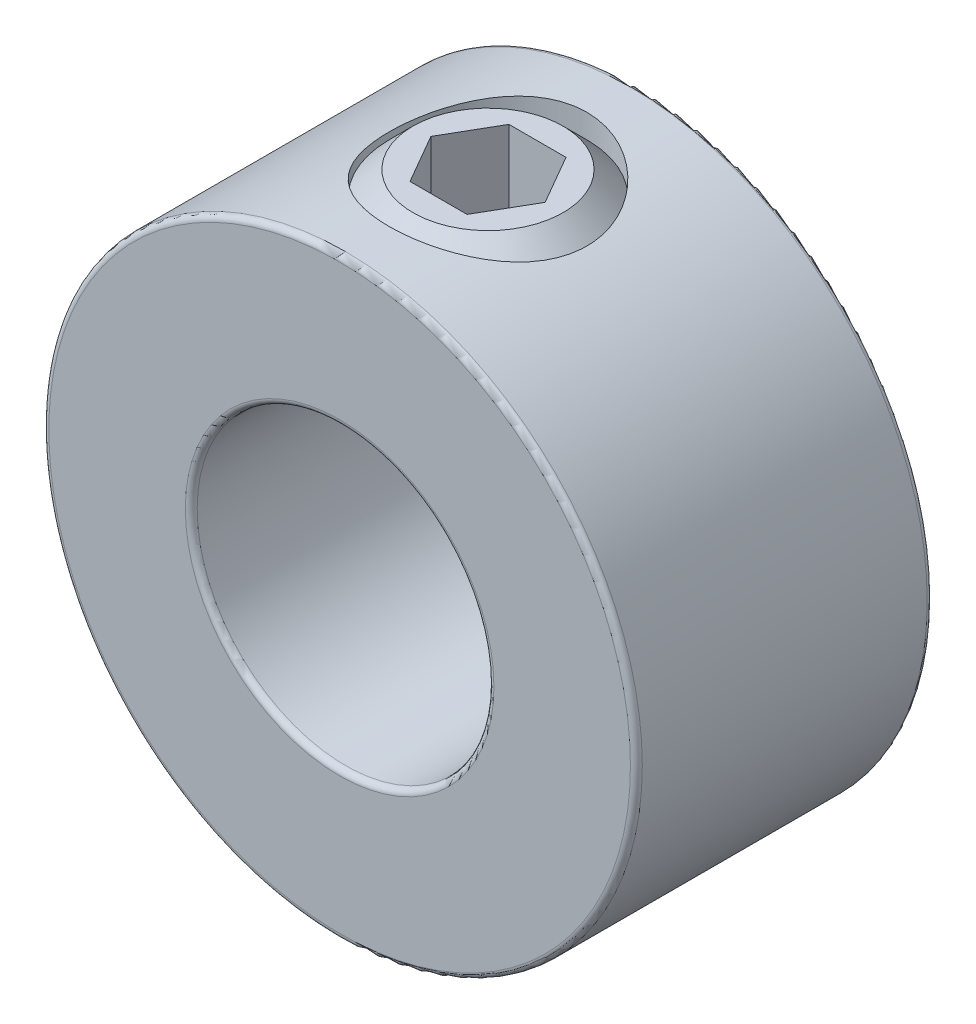
ISO-10303-21;
HEADER;
FILE_DESCRIPTION(('STEP AP214'),'2;1');
FILE_NAME('part.step','',(''),(''),'','','');
FILE_SCHEMA(('AUTOMOTIVE_DESIGN { 1 0 10303 214 1 1 1 1 }'));
ENDSEC;
DATA;
#1=APPLICATION_CONTEXT('core data for automotive mechanical design processes');
#2=APPLICATION_PROTOCOL_DEFINITION('international standard','automotive_design',2000,#1);
#3=PRODUCT_CONTEXT('',#1,'mechanical');
#4=PRODUCT('Part','Part','',(#3));
#5=PRODUCT_RELATED_PRODUCT_CATEGORY('part','',(#4));
#6=PRODUCT_DEFINITION_FORMATION('','',#4);
#7=PRODUCT_DEFINITION_CONTEXT('part definition',#1,'design');
#8=PRODUCT_DEFINITION('design','',#6,#7);
#9=PRODUCT_DEFINITION_SHAPE('','',#8);
#10=(LENGTH_UNIT() NAMED_UNIT(*) SI_UNIT(.MILLI.,.METRE.));
#11=(NAMED_UNIT(*) PLANE_ANGLE_UNIT() SI_UNIT($,.RADIAN.));
#12=(NAMED_UNIT(*) SI_UNIT($,.STERADIAN.) SOLID_ANGLE_UNIT());
#13=UNCERTAINTY_MEASURE_WITH_UNIT(LENGTH_MEASURE(1.E-05),#10,'distance_accuracy_value','');
#14=(GEOMETRIC_REPRESENTATION_CONTEXT(3) GLOBAL_UNCERTAINTY_ASSIGNED_CONTEXT((#13)) GLOBAL_UNIT_ASSIGNED_CONTEXT((#10,
#11,#12)) REPRESENTATION_CONTEXT('',''));
#15=CARTESIAN_POINT('',(0.,0.,0.));
#16=DIRECTION('',(0.,0.,1.));
#17=DIRECTION('',(1.,0.,0.));
#18=AXIS2_PLACEMENT_3D('',#15,#16,#17);
#19=CARTESIAN_POINT('',(0.,9.525,0.));
#20=DIRECTION('',(0.,1.,0.));
#21=DIRECTION('',(-1.,0.,0.));
#22=AXIS2_PLACEMENT_3D('',#19,#20,#21);
#23=PLANE('',#22);
#24=CARTESIAN_POINT('',(0.,9.525,0.));
#25=DIRECTION('',(0.,1.,0.));
#26=DIRECTION('',(-1.,0.,0.));
#27=AXIS2_PLACEMENT_3D('',#24,#25,#26);
#28=CIRCLE('',#27,2.40819263124403);
#29=CARTESIAN_POINT('',(-2.40819263124403,9.525,0.));
#30=VERTEX_POINT('',#29);
#31=EDGE_CURVE('E12',#30,#30,#28,.T.);
#32=ORIENTED_EDGE('',*,*,#31,.T.);
#33=EDGE_LOOP('',(#32));
#34=FACE_BOUND('',#33,.T.);
#35=DIRECTION('',(1.,0.,0.));
#36=VECTOR('',#35,1.);
#37=CARTESIAN_POINT('',(-0.91654355233853,9.52499999999999,-1.5875));
#38=LINE('',#37,#36);
#39=CARTESIAN_POINT('',(-0.91654355233853,9.52499999999999,-1.5875));
#40=VERTEX_POINT('',#39);
#41=CARTESIAN_POINT('',(0.916543552338532,9.525,-1.5875));
#42=VERTEX_POINT('',#41);
#43=EDGE_CURVE('E110',#40,#42,#38,.T.);
#44=ORIENTED_EDGE('',*,*,#43,.T.);
#45=DIRECTION('',(0.5,0.,0.866025403784439));
#46=VECTOR('',#45,1.);
#47=CARTESIAN_POINT('',(0.916543552338532,9.52499999999999,-1.5875));
#48=LINE('',#47,#46);
#49=CARTESIAN_POINT('',(1.83308710467706,9.52499999999999,0.));
#50=VERTEX_POINT('',#49);
#51=EDGE_CURVE('E56',#42,#50,#48,.T.);
#52=ORIENTED_EDGE('',*,*,#51,.T.);
#53=DIRECTION('',(-0.5,0.,0.866025403784439));
#54=VECTOR('',#53,1.);
#55=CARTESIAN_POINT('',(1.83308710467706,9.52499999999999,0.));
#56=LINE('',#55,#54);
#57=CARTESIAN_POINT('',(0.916543552338532,9.52499999999999,1.5875));
#58=VERTEX_POINT('',#57);
#59=EDGE_CURVE('E114',#50,#58,#56,.T.);
#60=ORIENTED_EDGE('',*,*,#59,.T.);
#61=DIRECTION('',(-1.,0.,0.));
#62=VECTOR('',#61,1.);
#63=CARTESIAN_POINT('',(0.916543552338532,9.52499999999999,1.5875));
#64=LINE('',#63,#62);
#65=CARTESIAN_POINT('',(-0.91654355233853,9.52499999999999,1.5875));
#66=VERTEX_POINT('',#65);
#67=EDGE_CURVE('E177',#58,#66,#64,.T.);
#68=ORIENTED_EDGE('',*,*,#67,.T.);
#69=DIRECTION('',(-0.5,0.,-0.866025403784438));
#70=VECTOR('',#69,1.);
#71=CARTESIAN_POINT('',(-0.91654355233853,9.52499999999999,1.5875));
#72=LINE('',#71,#70);
#73=CARTESIAN_POINT('',(-1.83308710467706,9.52499999999999,0.));
#74=VERTEX_POINT('',#73);
#75=EDGE_CURVE('E162',#66,#74,#72,.T.);
#76=ORIENTED_EDGE('',*,*,#75,.T.);
#77=DIRECTION('',(0.5,0.,-0.866025403784439));
#78=VECTOR('',#77,1.);
#79=CARTESIAN_POINT('',(-1.83308710467706,9.52499999999999,0.));
#80=LINE('',#79,#78);
#81=EDGE_CURVE('E158',#74,#40,#80,.T.);
#82=ORIENTED_EDGE('',*,*,#81,.T.);
#83=EDGE_LOOP('',(#44,#52,#60,#68,#76,#82));
#84=FACE_BOUND('',#83,.T.);
#85=ADVANCED_FACE('F42',(#34,#84),#23,.T.);
#86=CARTESIAN_POINT('',(0.,9.525,0.));
#87=DIRECTION('',(0.,-1.,0.));
#88=DIRECTION('',(1.,0.,0.));
#89=AXIS2_PLACEMENT_3D('',#86,#87,#88);
#90=CONICAL_SURFACE('',#89,2.40819263124403,0.785398163397448);
#91=CARTESIAN_POINT('',(0.,8.75819263124404,0.));
#92=DIRECTION('',(0.,1.,0.));
#93=DIRECTION('',(-1.,0.,0.));
#94=AXIS2_PLACEMENT_3D('',#91,#92,#93);
#95=CIRCLE('',#94,3.175);
#96=CARTESIAN_POINT('',(-3.175,8.75819263124404,0.));
#97=VERTEX_POINT('',#96);
#98=EDGE_CURVE('E49',#97,#97,#95,.T.);
#99=ORIENTED_EDGE('',*,*,#98,.T.);
#100=EDGE_LOOP('',(#99));
#101=FACE_BOUND('',#100,.T.);
#102=ORIENTED_EDGE('',*,*,#31,.F.);
#103=EDGE_LOOP('',(#102));
#104=FACE_BOUND('',#103,.T.);
#105=ADVANCED_FACE('F132',(#101,#104),#90,.T.);
#106=CARTESIAN_POINT('',(0.,4.7625,0.));
#107=DIRECTION('',(0.,1.,0.));
#108=DIRECTION('',(-1.,0.,0.));
#109=AXIS2_PLACEMENT_3D('',#106,#107,#108);
#110=CYLINDRICAL_SURFACE('',#109,3.175);
#111=CARTESIAN_POINT('',(0.,5.52930736875596,0.));
#112=DIRECTION('',(0.,1.,0.));
#113=DIRECTION('',(-1.,0.,0.));
#114=AXIS2_PLACEMENT_3D('',#111,#112,#113);
#115=CIRCLE('',#114,3.175);
#116=CARTESIAN_POINT('',(-3.175,5.52930736875596,0.));
#117=VERTEX_POINT('',#116);
#118=EDGE_CURVE('E127',#117,#117,#115,.T.);
#119=ORIENTED_EDGE('',*,*,#118,.T.);
#120=EDGE_LOOP('',(#119));
#121=FACE_BOUND('',#120,.T.);
#122=ORIENTED_EDGE('',*,*,#98,.F.);
#123=EDGE_LOOP('',(#122));
#124=FACE_BOUND('',#123,.T.);
#125=ADVANCED_FACE('F135',(#121,#124),#110,.T.);
#126=CARTESIAN_POINT('',(0.,5.52930736875596,0.));
#127=DIRECTION('',(0.,1.,0.));
#128=DIRECTION('',(-1.,0.,0.));
#129=AXIS2_PLACEMENT_3D('',#126,#127,#128);
#130=CONICAL_SURFACE('',#129,3.175,0.785398163397449);
#131=CARTESIAN_POINT('',(0.,4.7625,0.));
#132=DIRECTION('',(0.,1.,0.));
#133=DIRECTION('',(-1.,0.,0.));
#134=AXIS2_PLACEMENT_3D('',#131,#132,#133);
#135=CIRCLE('',#134,2.40819263124403);
#136=CARTESIAN_POINT('',(-2.40819263124403,4.7625,0.));
#137=VERTEX_POINT('',#136);
#138=EDGE_CURVE('E119',#137,#137,#135,.T.);
#139=ORIENTED_EDGE('',*,*,#138,.T.);
#140=EDGE_LOOP('',(#139));
#141=FACE_BOUND('',#140,.T.);
#142=ORIENTED_EDGE('',*,*,#118,.F.);
#143=EDGE_LOOP('',(#142));
#144=FACE_BOUND('',#143,.T.);
#145=ADVANCED_FACE('F137',(#141,#144),#130,.T.);
#146=CARTESIAN_POINT('',(-2.40819263124403,4.7625,0.));
#147=DIRECTION('',(0.,-1.,0.));
#148=DIRECTION('',(1.,0.,0.));
#149=AXIS2_PLACEMENT_3D('',#146,#147,#148);
#150=PLANE('',#149);
#151=CARTESIAN_POINT('',(0.,4.7625,0.));
#152=DIRECTION('',(0.,1.,0.));
#153=DIRECTION('',(-1.,0.,0.));
#154=AXIS2_PLACEMENT_3D('',#151,#152,#153);
#155=CIRCLE('',#154,0.920168842507157);
#156=CARTESIAN_POINT('',(-0.920168842507157,4.7625,0.));
#157=VERTEX_POINT('',#156);
#158=EDGE_CURVE('E115',#157,#157,#155,.T.);
#159=ORIENTED_EDGE('',*,*,#158,.T.);
#160=EDGE_LOOP('',(#159));
#161=FACE_BOUND('',#160,.T.);
#162=ORIENTED_EDGE('',*,*,#138,.F.);
#163=EDGE_LOOP('',(#162));
#164=FACE_BOUND('',#163,.T.);
#165=ADVANCED_FACE('F144',(#161,#164),#150,.T.);
#166=CARTESIAN_POINT('',(0.,4.7625,0.));
#167=DIRECTION('',(0.,-1.,0.));
#168=DIRECTION('',(1.,0.,0.));
#169=AXIS2_PLACEMENT_3D('',#166,#167,#168);
#170=CONICAL_SURFACE('',#169,0.920168842507157,0.785398163397448);
#171=CARTESIAN_POINT('',(0.,5.68266884250716,0.));
#172=VERTEX_POINT('',#171);
#173=VERTEX_LOOP('',#172);
#174=FACE_BOUND('',#173,.T.);
#175=ORIENTED_EDGE('',*,*,#158,.F.);
#176=EDGE_LOOP('',(#175));
#177=FACE_BOUND('',#176,.T.);
#178=ADVANCED_FACE('F211',(#174,#177),#170,.F.);
#179=CARTESIAN_POINT('',(0.916543552338532,6.34999999999999,-1.5875));
#180=DIRECTION('',(-0.866025403784438,0.,0.5));
#181=DIRECTION('',(0.5,0.,0.866025403784439));
#182=AXIS2_PLACEMENT_3D('',#179,#180,#181);
#183=PLANE('',#182);
#184=ORIENTED_EDGE('',*,*,#51,.F.);
#185=DIRECTION('',(0.,1.,0.));
#186=VECTOR('',#185,1.);
#187=CARTESIAN_POINT('',(0.916543552338532,6.34999999999999,-1.5875));
#188=LINE('',#187,#186);
#189=CARTESIAN_POINT('',(0.916543552338532,6.34999999999999,-1.5875));
#190=VERTEX_POINT('',#189);
#191=EDGE_CURVE('E109',#190,#42,#188,.T.);
#192=ORIENTED_EDGE('',*,*,#191,.F.);
#193=DIRECTION('',(0.5,0.,0.866025403784439));
#194=VECTOR('',#193,1.);
#195=CARTESIAN_POINT('',(0.916543552338532,6.34999999999999,-1.5875));
#196=LINE('',#195,#194);
#197=CARTESIAN_POINT('',(1.83308710467706,6.34999999999999,0.));
#198=VERTEX_POINT('',#197);
#199=EDGE_CURVE('E100',#190,#198,#196,.T.);
#200=ORIENTED_EDGE('',*,*,#199,.T.);
#201=DIRECTION('',(0.,1.,0.));
#202=VECTOR('',#201,1.);
#203=CARTESIAN_POINT('',(1.83308710467706,6.34999999999999,0.));
#204=LINE('',#203,#202);
#205=EDGE_CURVE('E108',#198,#50,#204,.T.);
#206=ORIENTED_EDGE('',*,*,#205,.T.);
#207=EDGE_LOOP('',(#184,#192,#200,#206));
#208=FACE_BOUND('',#207,.T.);
#209=ADVANCED_FACE('F107',(#208),#183,.T.);
#210=CARTESIAN_POINT('',(1.83308710467706,6.34999999999999,0.));
#211=DIRECTION('',(-0.866025403784439,0.,-0.5));
#212=DIRECTION('',(-0.5,0.,0.866025403784439));
#213=AXIS2_PLACEMENT_3D('',#210,#211,#212);
#214=PLANE('',#213);
#215=ORIENTED_EDGE('',*,*,#59,.F.);
#216=ORIENTED_EDGE('',*,*,#205,.F.);
#217=DIRECTION('',(-0.5,0.,0.866025403784439));
#218=VECTOR('',#217,1.);
#219=CARTESIAN_POINT('',(1.83308710467706,6.34999999999999,0.));
#220=LINE('',#219,#218);
#221=CARTESIAN_POINT('',(0.916543552338532,6.34999999999999,1.5875));
#222=VERTEX_POINT('',#221);
#223=EDGE_CURVE('E96',#198,#222,#220,.T.);
#224=ORIENTED_EDGE('',*,*,#223,.T.);
#225=DIRECTION('',(0.,1.,0.));
#226=VECTOR('',#225,1.);
#227=CARTESIAN_POINT('',(0.916543552338532,6.34999999999999,1.5875));
#228=LINE('',#227,#226);
#229=EDGE_CURVE('E116',#222,#58,#228,.T.);
#230=ORIENTED_EDGE('',*,*,#229,.T.);
#231=EDGE_LOOP('',(#215,#216,#224,#230));
#232=FACE_BOUND('',#231,.T.);
#233=ADVANCED_FACE('F112',(#232),#214,.T.);
#234=CARTESIAN_POINT('',(0.916543552338532,6.34999999999999,1.5875));
#235=DIRECTION('',(0.,0.,-1.));
#236=DIRECTION('',(-1.,0.,0.));
#237=AXIS2_PLACEMENT_3D('',#234,#235,#236);
#238=PLANE('',#237);
#239=ORIENTED_EDGE('',*,*,#67,.F.);
#240=ORIENTED_EDGE('',*,*,#229,.F.);
#241=DIRECTION('',(-1.,0.,0.));
#242=VECTOR('',#241,1.);
#243=CARTESIAN_POINT('',(0.916543552338532,6.34999999999999,1.5875));
#244=LINE('',#243,#242);
#245=CARTESIAN_POINT('',(-0.91654355233853,6.34999999999999,1.5875));
#246=VERTEX_POINT('',#245);
#247=EDGE_CURVE('E102',#222,#246,#244,.T.);
#248=ORIENTED_EDGE('',*,*,#247,.T.);
#249=DIRECTION('',(0.,1.,0.));
#250=VECTOR('',#249,1.);
#251=CARTESIAN_POINT('',(-0.91654355233853,6.34999999999999,1.5875));
#252=LINE('',#251,#250);
#253=EDGE_CURVE('E121',#246,#66,#252,.T.);
#254=ORIENTED_EDGE('',*,*,#253,.T.);
#255=EDGE_LOOP('',(#239,#240,#248,#254));
#256=FACE_BOUND('',#255,.T.);
#257=ADVANCED_FACE('F175',(#256),#238,.T.);
#258=CARTESIAN_POINT('',(-0.91654355233853,6.34999999999999,1.5875));
#259=DIRECTION('',(0.866025403784438,0.,-0.5));
#260=DIRECTION('',(-0.5,0.,-0.866025403784439));
#261=AXIS2_PLACEMENT_3D('',#258,#259,#260);
#262=PLANE('',#261);
#263=ORIENTED_EDGE('',*,*,#75,.F.);
#264=ORIENTED_EDGE('',*,*,#253,.F.);
#265=DIRECTION('',(-0.5,0.,-0.866025403784438));
#266=VECTOR('',#265,1.);
#267=CARTESIAN_POINT('',(-0.91654355233853,6.34999999999999,1.5875));
#268=LINE('',#267,#266);
#269=CARTESIAN_POINT('',(-1.83308710467706,6.34999999999999,0.));
#270=VERTEX_POINT('',#269);
#271=EDGE_CURVE('E188',#246,#270,#268,.T.);
#272=ORIENTED_EDGE('',*,*,#271,.T.);
#273=DIRECTION('',(0.,1.,0.));
#274=VECTOR('',#273,1.);
#275=CARTESIAN_POINT('',(-1.83308710467706,6.34999999999999,0.));
#276=LINE('',#275,#274);
#277=EDGE_CURVE('E170',#270,#74,#276,.T.);
#278=ORIENTED_EDGE('',*,*,#277,.T.);
#279=EDGE_LOOP('',(#263,#264,#272,#278));
#280=FACE_BOUND('',#279,.T.);
#281=ADVANCED_FACE('F179',(#280),#262,.T.);
#282=CARTESIAN_POINT('',(-1.83308710467706,6.34999999999999,0.));
#283=DIRECTION('',(0.866025403784439,0.,0.5));
#284=DIRECTION('',(0.5,0.,-0.866025403784439));
#285=AXIS2_PLACEMENT_3D('',#282,#283,#284);
#286=PLANE('',#285);
#287=ORIENTED_EDGE('',*,*,#81,.F.);
#288=ORIENTED_EDGE('',*,*,#277,.F.);
#289=DIRECTION('',(0.5,0.,-0.866025403784439));
#290=VECTOR('',#289,1.);
#291=CARTESIAN_POINT('',(-1.83308710467706,6.34999999999999,0.));
#292=LINE('',#291,#290);
#293=CARTESIAN_POINT('',(-0.91654355233853,6.34999999999999,-1.5875));
#294=VERTEX_POINT('',#293);
#295=EDGE_CURVE('E186',#270,#294,#292,.T.);
#296=ORIENTED_EDGE('',*,*,#295,.T.);
#297=DIRECTION('',(0.,1.,0.));
#298=VECTOR('',#297,1.);
#299=CARTESIAN_POINT('',(-0.91654355233853,6.34999999999999,-1.5875));
#300=LINE('',#299,#298);
#301=EDGE_CURVE('E167',#294,#40,#300,.T.);
#302=ORIENTED_EDGE('',*,*,#301,.T.);
#303=EDGE_LOOP('',(#287,#288,#296,#302));
#304=FACE_BOUND('',#303,.T.);
#305=ADVANCED_FACE('F192',(#304),#286,.T.);
#306=CARTESIAN_POINT('',(-0.91654355233853,6.34999999999999,-1.5875));
#307=DIRECTION('',(0.,0.,1.));
#308=DIRECTION('',(1.,0.,0.));
#309=AXIS2_PLACEMENT_3D('',#306,#307,#308);
#310=PLANE('',#309);
#311=ORIENTED_EDGE('',*,*,#43,.F.);
#312=ORIENTED_EDGE('',*,*,#301,.F.);
#313=DIRECTION('',(1.,0.,0.));
#314=VECTOR('',#313,1.);
#315=CARTESIAN_POINT('',(-0.91654355233853,6.34999999999999,-1.5875));
#316=LINE('',#315,#314);
#317=EDGE_CURVE('E168',#294,#190,#316,.T.);
#318=ORIENTED_EDGE('',*,*,#317,.T.);
#319=ORIENTED_EDGE('',*,*,#191,.T.);
#320=EDGE_LOOP('',(#311,#312,#318,#319));
#321=FACE_BOUND('',#320,.T.);
#322=ADVANCED_FACE('F193',(#321),#310,.T.);
#323=CARTESIAN_POINT('',(0.,6.34999999999999,-3.175));
#324=DIRECTION('',(0.,1.,0.));
#325=DIRECTION('',(0.,0.,1.));
#326=AXIS2_PLACEMENT_3D('',#323,#324,#325);
#327=PLANE('',#326);
#328=ORIENTED_EDGE('',*,*,#199,.F.);
#329=ORIENTED_EDGE('',*,*,#317,.F.);
#330=ORIENTED_EDGE('',*,*,#295,.F.);
#331=ORIENTED_EDGE('',*,*,#271,.F.);
#332=ORIENTED_EDGE('',*,*,#247,.F.);
#333=ORIENTED_EDGE('',*,*,#223,.F.);
#334=EDGE_LOOP('',(#328,#329,#330,#331,#332,#333));
#335=FACE_BOUND('',#334,.T.);
#336=ADVANCED_FACE('F98',(#335),#327,.T.);
#337=CLOSED_SHELL('',(#85,#105,#125,#145,#165,#178,#209,#233,#257,#281,#305,#322,#336));
#338=MANIFOLD_SOLID_BREP('B2',#337);
#339=CARTESIAN_POINT('',(0.,0.,4.7625));
#340=DIRECTION('',(0.,0.,1.));
#341=DIRECTION('',(1.,0.,0.));
#342=AXIS2_PLACEMENT_3D('',#339,#340,#341);
#343=PLANE('',#342);
#344=CARTESIAN_POINT('',(0.,0.,4.7625));
#345=DIRECTION('',(0.,0.,1.));
#346=DIRECTION('',(1.,0.,0.));
#347=AXIS2_PLACEMENT_3D('',#344,#345,#346);
#348=CIRCLE('',#347,4.953);
#349=CARTESIAN_POINT('',(4.953,0.,4.7625));
#350=VERTEX_POINT('',#349);
#351=EDGE_CURVE('E307',#350,#350,#348,.F.);
#352=ORIENTED_EDGE('',*,*,#351,.T.);
#353=EDGE_LOOP('',(#352));
#354=FACE_BOUND('',#353,.T.);
#355=CARTESIAN_POINT('',(0.,0.,4.7625));
#356=DIRECTION('',(0.,0.,1.));
#357=DIRECTION('',(1.,0.,0.));
#358=AXIS2_PLACEMENT_3D('',#355,#356,#357);
#359=CIRCLE('',#358,9.3345);
#360=CARTESIAN_POINT('',(9.3345,0.,4.7625));
#361=VERTEX_POINT('',#360);
#362=EDGE_CURVE('E311',#361,#361,#359,.T.);
#363=ORIENTED_EDGE('',*,*,#362,.T.);
#364=EDGE_LOOP('',(#363));
#365=FACE_BOUND('',#364,.T.);
#366=ADVANCED_FACE('F296',(#354,#365),#343,.T.);
#367=CARTESIAN_POINT('',(0.,0.,-4.7625));
#368=DIRECTION('',(0.,0.,1.));
#369=DIRECTION('',(1.,0.,0.));
#370=AXIS2_PLACEMENT_3D('',#367,#368,#369);
#371=PLANE('',#370);
#372=CARTESIAN_POINT('',(0.,0.,-4.7625));
#373=DIRECTION('',(0.,0.,1.));
#374=DIRECTION('',(1.,0.,0.));
#375=AXIS2_PLACEMENT_3D('',#372,#373,#374);
#376=CIRCLE('',#375,4.953);
#377=CARTESIAN_POINT('',(4.953,0.,-4.7625));
#378=VERTEX_POINT('',#377);
#379=EDGE_CURVE('E322',#378,#378,#376,.T.);
#380=ORIENTED_EDGE('',*,*,#379,.T.);
#381=EDGE_LOOP('',(#380));
#382=FACE_BOUND('',#381,.T.);
#383=CARTESIAN_POINT('',(0.,0.,-4.7625));
#384=DIRECTION('',(0.,0.,1.));
#385=DIRECTION('',(1.,0.,0.));
#386=AXIS2_PLACEMENT_3D('',#383,#384,#385);
#387=CIRCLE('',#386,9.3345);
#388=CARTESIAN_POINT('',(9.3345,0.,-4.7625));
#389=VERTEX_POINT('',#388);
#390=EDGE_CURVE('E325',#389,#389,#387,.F.);
#391=ORIENTED_EDGE('',*,*,#390,.T.);
#392=EDGE_LOOP('',(#391));
#393=FACE_BOUND('',#392,.T.);
#394=ADVANCED_FACE('F359',(#382,#393),#371,.F.);
#395=CARTESIAN_POINT('',(0.,0.,4.7625));
#396=DIRECTION('',(0.,0.,-1.));
#397=DIRECTION('',(-1.,0.,0.));
#398=AXIS2_PLACEMENT_3D('',#395,#396,#397);
#399=CYLINDRICAL_SURFACE('',#398,9.525);
#400=CARTESIAN_POINT('',(0.,0.,-4.572));
#401=DIRECTION('',(0.,0.,1.));
#402=DIRECTION('',(1.,0.,0.));
#403=AXIS2_PLACEMENT_3D('',#400,#401,#402);
#404=CIRCLE('',#403,9.525);
#405=CARTESIAN_POINT('',(9.525,0.,-4.572));
#406=VERTEX_POINT('',#405);
#407=EDGE_CURVE('E41',#406,#406,#404,.T.);
#408=ORIENTED_EDGE('',*,*,#407,.T.);
#409=EDGE_LOOP('',(#408));
#410=FACE_BOUND('',#409,.T.);
#411=CARTESIAN_POINT('',(0.,0.,4.572));
#412=DIRECTION('',(0.,0.,1.));
#413=DIRECTION('',(1.,0.,0.));
#414=AXIS2_PLACEMENT_3D('',#411,#412,#413);
#415=CIRCLE('',#414,9.525);
#416=CARTESIAN_POINT('',(9.525,0.,4.572));
#417=VERTEX_POINT('',#416);
#418=EDGE_CURVE('E303',#417,#417,#415,.F.);
#419=ORIENTED_EDGE('',*,*,#418,.T.);
#420=EDGE_LOOP('',(#419));
#421=FACE_BOUND('',#420,.T.);
#422=CARTESIAN_POINT('',(0.,9.525,-3.175));
#423=CARTESIAN_POINT('',(0.173238677165346,9.52500048580498,-3.17500080559796));
#424=CARTESIAN_POINT('',(0.346472492659896,9.52023018186455,-3.16077515504608));
#425=CARTESIAN_POINT('',(0.687837590771686,9.50167042395416,-3.10442257950533));
#426=CARTESIAN_POINT('',(0.855968341777246,9.48788003366834,-3.06229275796217));
#427=CARTESIAN_POINT('',(1.18215660666814,9.45277852602955,-2.95173640225564));
#428=CARTESIAN_POINT('',(1.34023044718816,9.43147998545459,-2.88335382669181));
#429=CARTESIAN_POINT('',(1.6426654243569,9.3835361515256,-2.72243177623824));
#430=CARTESIAN_POINT('',(1.78702384834389,9.35688980370195,-2.62988753611674));
#431=CARTESIAN_POINT('',(2.06292981819569,9.30002249856541,-2.41990306957346));
#432=CARTESIAN_POINT('',(2.19393674844713,9.26971591772517,-2.30177583122293));
#433=CARTESIAN_POINT('',(2.43469379932911,9.20941499436411,-2.04543928380665));
#434=CARTESIAN_POINT('',(2.54443923892904,9.17942072197493,-1.90722556410197));
#435=CARTESIAN_POINT('',(2.74264419157345,9.12219830615344,-1.60977225925124));
#436=CARTESIAN_POINT('',(2.83040092485178,9.0950744970031,-1.45004237635051));
#437=CARTESIAN_POINT('',(2.97757492456176,9.04796594704059,-1.11704090009411));
#438=CARTESIAN_POINT('',(3.03700083920298,9.02797902810367,-0.943773458008286));
#439=CARTESIAN_POINT('',(3.12379824029159,8.99830887880273,-0.594762521747942));
#440=CARTESIAN_POINT('',(3.15218269826287,8.98830104068516,-0.419299363047218));
#441=CARTESIAN_POINT('',(3.17925806658696,8.97876209798686,-0.065837580555076));
#442=CARTESIAN_POINT('',(3.17795815259498,8.97922775597168,0.112160242751682));
#443=CARTESIAN_POINT('',(3.14648819425835,8.99029872650972,0.45699880165977));
#444=CARTESIAN_POINT('',(3.11764017430521,9.00043970379417,0.623977679267887));
#445=CARTESIAN_POINT('',(3.0340495670469,9.02895888275449,0.950574107251702));
#446=CARTESIAN_POINT('',(2.97930387942919,9.04733807064542,1.11019077375635));
#447=CARTESIAN_POINT('',(2.84460650934117,9.09059367841715,1.42053547995295));
#448=CARTESIAN_POINT('',(2.76426310464556,9.11556996393148,1.57107898086575));
#449=CARTESIAN_POINT('',(2.58092291251247,9.16916373477931,1.85696513378813));
#450=CARTESIAN_POINT('',(2.47791958175572,9.19778227084722,1.99230337801349));
#451=CARTESIAN_POINT('',(2.2458341312661,9.25726270107577,2.25136582416045));
#452=CARTESIAN_POINT('',(2.11567125149229,9.28816371201626,2.3741148050663));
#453=CARTESIAN_POINT('',(1.83622813465495,9.34742029378842,2.59629677165629));
#454=CARTESIAN_POINT('',(1.68694606622308,9.37577562033364,2.69572752117228));
#455=CARTESIAN_POINT('',(1.3714336714219,9.42711817702495,2.86923575324634));
#456=CARTESIAN_POINT('',(1.20504990262187,9.45004936275525,2.94305193500683));
#457=CARTESIAN_POINT('',(0.861279339682312,9.4875530068358,3.06134507730938));
#458=CARTESIAN_POINT('',(0.683896391141978,9.50212836854242,3.10583222946942));
#459=CARTESIAN_POINT('',(0.33141865875554,9.52079715951823,3.16247673962099));
#460=CARTESIAN_POINT('',(0.156557979570887,9.52531755822087,3.17595189412349));
#461=CARTESIAN_POINT('',(-0.192960847123753,9.52464766056077,3.17394376132486));
#462=CARTESIAN_POINT('',(-0.36761902383989,9.51945900331475,3.15846536206389));
#463=CARTESIAN_POINT('',(-0.706500575516011,9.50023578476806,3.10003219293833));
#464=CARTESIAN_POINT('',(-0.870879661700627,9.48646180908036,3.05788629579286));
#465=CARTESIAN_POINT('',(-1.19016766849014,9.45171613685472,2.94832581381814));
#466=CARTESIAN_POINT('',(-1.34507537851482,9.43074352248193,2.88090800668978));
#467=CARTESIAN_POINT('',(-1.64556534104864,9.38304356837145,2.72075137890551));
#468=CARTESIAN_POINT('',(-1.79079512051444,9.35617936849621,2.62739316632593));
#469=CARTESIAN_POINT('',(-2.06395583568049,9.29974181184133,2.41873357370719));
#470=CARTESIAN_POINT('',(-2.19188146775096,9.27016762910402,2.30342549209915));
#471=CARTESIAN_POINT('',(-2.432851712285,9.20993992337912,2.04794246555408));
#472=CARTESIAN_POINT('',(-2.54495607735532,9.17929841452584,1.90687570450722));
#473=CARTESIAN_POINT('',(-2.74401763337735,9.121774152107,1.60727527220044));
#474=CARTESIAN_POINT('',(-2.83097461468097,9.09489142987857,1.44874145533681));
#475=CARTESIAN_POINT('',(-2.97687025407195,9.04819093937643,1.11863817645458));
#476=CARTESIAN_POINT('',(-3.03586556962394,9.02835890517708,0.947095898639171));
#477=CARTESIAN_POINT('',(-3.12386556696095,8.99829392572977,0.595697786109888));
#478=CARTESIAN_POINT('',(-3.15288375947876,8.98805665630055,0.415845734841193));
#479=CARTESIAN_POINT('',(-3.17905219686556,8.97883201925513,0.0628742200700937));
#480=CARTESIAN_POINT('',(-3.17776306695417,8.97929370817293,-0.110116430410661));
#481=CARTESIAN_POINT('',(-3.1471942816996,8.99005281690779,-0.453279112877545));
#482=CARTESIAN_POINT('',(-3.11791629228101,9.00034965132723,-0.623451312007403));
#483=CARTESIAN_POINT('',(-3.03330550668567,9.02920864668031,-0.952930730032847));
#484=CARTESIAN_POINT('',(-2.97847812359926,9.04761011221366,-1.11238291938927));
#485=CARTESIAN_POINT('',(-2.84473448628719,9.09054566248638,-1.419947017029));
#486=CARTESIAN_POINT('',(-2.76581288515833,9.11508110823773,-1.56805639902192));
#487=CARTESIAN_POINT('',(-2.58210269895239,9.16885482792697,-1.85573565200524));
#488=CARTESIAN_POINT('',(-2.47633567077754,9.19825159463785,-1.99465089352737));
#489=CARTESIAN_POINT('',(-2.24359115395568,9.25777156199328,-2.25326515749483));
#490=CARTESIAN_POINT('',(-2.11660766813345,9.28789496596782,-2.37295872780963));
#491=CARTESIAN_POINT('',(-1.83909194322319,9.34688346918603,-2.59443350901814));
#492=CARTESIAN_POINT('',(-1.68783480536164,9.3756537721899,-2.69533480410942));
#493=CARTESIAN_POINT('',(-1.36955960976604,9.42740021973043,-2.8701696116008));
#494=CARTESIAN_POINT('',(-1.20254559507021,9.45037784507677,-2.94411001830248));
#495=CARTESIAN_POINT('',(-0.865167329863099,9.4870751034262,-3.05981618315153));
#496=CARTESIAN_POINT('',(-0.695286130622597,9.50116249441509,-3.10287183038622));
#497=CARTESIAN_POINT('',(-0.350267320832534,9.52012342428904,-3.16045939114987));
#498=CARTESIAN_POINT('',(-0.175131176180769,9.52499950888798,-3.1749991856015));
#499=CARTESIAN_POINT('',(0.,9.525,-3.175));
#500=B_SPLINE_CURVE_WITH_KNOTS('',3,(#422,#423,#424,#425,#426,#427,#428,#429,#430,#431,#432,
#433,#434,#435,#436,#437,#438,#439,#440,#441,#442,#443,#444,#445,#446,#447,#448,#449,#450,#451,
#452,#453,#454,#455,#456,#457,#458,#459,#460,#461,#462,#463,#464,#465,#466,#467,#468,#469,#470,
#471,#472,#473,#474,#475,#476,#477,#478,#479,#480,#481,#482,#483,#484,#485,#486,#487,#488,#489,
#490,#491,#492,#493,#494,#495,#496,#497,#498,#499),.UNSPECIFIED.,.T.,.F.,(4,2,2,2,2,2,2,2,2,2,2,
2,2,2,2,2,2,2,2,2,2,2,2,2,2,2,2,2,2,2,2,2,2,2,2,2,2,2,4),(0.,0.519071561632585,1.03819701322438,
1.55645698636312,2.07481924951214,2.6093637259775,3.14402575687908,3.69406121814519,
4.24392866899746,4.77526114230342,5.30642937910266,5.81332424300314,6.32027980466155,
6.83539943417539,7.35066800622307,7.8928374595109,8.43505888444013,8.98265937939885,
9.53006948685136,10.0537512658116,10.5773446429626,11.0857715158083,11.5942632377703,
12.1161301950386,12.638156741095,13.1839024764639,13.7296527614611,14.274292439,
14.8186865394104,15.3351123975402,15.8515075194062,16.3580948898032,16.8647947620873,
17.3936046174648,17.92256420318,18.4721392315144,19.0215736265905,19.5464607283686,
20.0712027467109),.UNSPECIFIED.);
#501=CARTESIAN_POINT('',(0.,9.525,-3.175));
#502=VERTEX_POINT('',#501);
#503=EDGE_CURVE('E328',#502,#502,#500,.T.);
#504=ORIENTED_EDGE('',*,*,#503,.T.);
#505=EDGE_LOOP('',(#504));
#506=FACE_BOUND('',#505,.T.);
#507=ADVANCED_FACE('F355',(#410,#421,#506),#399,.T.);
#508=CARTESIAN_POINT('',(0.,0.,4.7625));
#509=DIRECTION('',(0.,0.,-1.));
#510=DIRECTION('',(-1.,0.,0.));
#511=AXIS2_PLACEMENT_3D('',#508,#509,#510);
#512=CYLINDRICAL_SURFACE('',#511,4.7625);
#513=CARTESIAN_POINT('',(0.,0.,-4.572));
#514=DIRECTION('',(0.,0.,1.));
#515=DIRECTION('',(1.,0.,0.));
#516=AXIS2_PLACEMENT_3D('',#513,#514,#515);
#517=CIRCLE('',#516,4.7625);
#518=CARTESIAN_POINT('',(4.7625,0.,-4.572));
#519=VERTEX_POINT('',#518);
#520=EDGE_CURVE('E316',#519,#519,#517,.F.);
#521=ORIENTED_EDGE('',*,*,#520,.T.);
#522=EDGE_LOOP('',(#521));
#523=FACE_BOUND('',#522,.T.);
#524=CARTESIAN_POINT('',(0.,0.,4.572));
#525=DIRECTION('',(0.,0.,1.));
#526=DIRECTION('',(1.,0.,0.));
#527=AXIS2_PLACEMENT_3D('',#524,#525,#526);
#528=CIRCLE('',#527,4.7625);
#529=CARTESIAN_POINT('',(4.7625,0.,4.572));
#530=VERTEX_POINT('',#529);
#531=EDGE_CURVE('E319',#530,#530,#528,.T.);
#532=ORIENTED_EDGE('',*,*,#531,.T.);
#533=EDGE_LOOP('',(#532));
#534=FACE_BOUND('',#533,.T.);
#535=CARTESIAN_POINT('',(0.,4.7625,-3.175));
#536=CARTESIAN_POINT('',(0.159513506146526,4.76249829558772,-3.17499785387674));
#537=CARTESIAN_POINT('',(0.319036822940597,4.75441585981929,-3.16291201378244));
#538=CARTESIAN_POINT('',(0.632990333269339,4.72288699141972,-3.1153157875296));
#539=CARTESIAN_POINT('',(0.787418072256468,4.6994332647002,-3.07979428046729));
#540=CARTESIAN_POINT('',(1.0861866118583,4.63947623936465,-2.98750378332687));
#541=CARTESIAN_POINT('',(1.23057094564588,4.60303407934685,-2.93083428235374));
#542=CARTESIAN_POINT('',(1.50719688917279,4.52002748417047,-2.79866196869855));
#543=CARTESIAN_POINT('',(1.63943673208792,4.47346157948094,-2.72315642160038));
#544=CARTESIAN_POINT('',(1.90068942785739,4.36923384005694,-2.54848209446027));
#545=CARTESIAN_POINT('',(2.0284762255929,4.31096574538352,-2.44784901636421));
#546=CARTESIAN_POINT('',(2.26651828028912,4.19071922389352,-2.22927855246795));
#547=CARTESIAN_POINT('',(2.37674794067855,4.12873555797057,-2.11131637522972));
#548=CARTESIAN_POINT('',(2.59432897361932,3.99618620055343,-1.83982936485523));
#549=CARTESIAN_POINT('',(2.69848308269039,3.92580920318787,-1.68363002512644));
#550=CARTESIAN_POINT('',(2.87893691841686,3.79546083955007,-1.35197313839848));
#551=CARTESIAN_POINT('',(2.95528481583058,3.73547157335729,-1.17654958761288));
#552=CARTESIAN_POINT('',(3.0587003056751,3.65087323287846,-0.862470821626492));
#553=CARTESIAN_POINT('',(3.09363184983488,3.62104984276855,-0.727823581043082));
#554=CARTESIAN_POINT('',(3.14564105737718,3.57597026836952,-0.452843098742185));
#555=CARTESIAN_POINT('',(3.16274949511548,3.56068897885195,-0.312520093909076));
#556=CARTESIAN_POINT('',(3.17803790572636,3.54705611398895,-0.0294087885536061));
#557=CARTESIAN_POINT('',(3.17614050629003,3.54877374048434,0.113387224758058));
#558=CARTESIAN_POINT('',(3.1533716036927,3.56901393593137,0.396295520403469));
#559=CARTESIAN_POINT('',(3.13248402562585,3.58755074204361,0.536405426371809));
#560=CARTESIAN_POINT('',(3.07443178311274,3.63739407712628,0.804016443958601));
#561=CARTESIAN_POINT('',(3.03802591942409,3.66810112544892,0.931801121179955));
#562=CARTESIAN_POINT('',(2.95068813219861,3.73871526235139,1.17955010979676));
#563=CARTESIAN_POINT('',(2.89975142875274,3.77862537744388,1.29951183185715));
#564=CARTESIAN_POINT('',(2.77294687249444,3.87293161809884,1.55420281498847));
#565=CARTESIAN_POINT('',(2.69411533030023,3.92862304429405,1.68697259197917));
#566=CARTESIAN_POINT('',(2.51886974692605,4.04322816135652,1.93894614005392));
#567=CARTESIAN_POINT('',(2.42243402035992,4.10214576296336,2.05813288170832));
#568=CARTESIAN_POINT('',(2.19045099950254,4.23137558230652,2.30591129113202));
#569=CARTESIAN_POINT('',(2.05095377025594,4.30140657245416,2.43099280228032));
#570=CARTESIAN_POINT('',(1.74943769853673,4.43258734804498,2.65619943508341));
#571=CARTESIAN_POINT('',(1.58744015020742,4.493745420159,2.75634790583761));
#572=CARTESIAN_POINT('',(1.2777118005163,4.59018328993748,2.91064587831312));
#573=CARTESIAN_POINT('',(1.13340775885306,4.62818577100373,2.96996383930038));
#574=CARTESIAN_POINT('',(0.835082219747426,4.69118503960837,3.06721656943046));
#575=CARTESIAN_POINT('',(0.681069057915083,4.71619281752454,3.10516941057244));
#576=CARTESIAN_POINT('',(0.366689406911032,4.75100462923954,3.15779334981527));
#577=CARTESIAN_POINT('',(0.206298501445472,4.76074299407139,3.17236389423949));
#578=CARTESIAN_POINT('',(-0.115000912030585,4.76381945007165,3.17697975309251));
#579=CARTESIAN_POINT('',(-0.27590938307122,4.75715868774695,3.16702678202589));
#580=CARTESIAN_POINT('',(-0.581748451061773,4.72915598211033,3.12479681179543));
#581=CARTESIAN_POINT('',(-0.727007443428387,4.70887816144478,3.09413703981371));
#582=CARTESIAN_POINT('',(-1.00983477297833,4.65643038239684,3.01371684845446));
#583=CARTESIAN_POINT('',(-1.14740187964354,4.62425852748368,2.963953382901));
#584=CARTESIAN_POINT('',(-1.42028029136544,4.54812959640013,2.84376447844169));
#585=CARTESIAN_POINT('',(-1.55495019310495,4.50357668840463,2.77227005539697));
#586=CARTESIAN_POINT('',(-1.81083430052963,4.40692945783369,2.61233715220837));
#587=CARTESIAN_POINT('',(-1.93204012275933,4.35483048266614,2.52388820764801));
#588=CARTESIAN_POINT('',(-2.17781894704302,4.23790342811906,2.31678500930826));
#589=CARTESIAN_POINT('',(-2.29989360271145,4.17236523918599,2.19556606216409));
#590=CARTESIAN_POINT('',(-2.52307674305786,4.04131737275621,1.93498560490976));
#591=CARTESIAN_POINT('',(-2.62417073664107,3.97580774594569,1.79561166279185));
#592=CARTESIAN_POINT('',(-2.79598082787364,3.85666740360083,1.51266141984501));
#593=CARTESIAN_POINT('',(-2.86854322403869,3.80250060257811,1.37043789728911));
#594=CARTESIAN_POINT('',(-2.99237739257787,3.70584371667973,1.07335216383611));
#595=CARTESIAN_POINT('',(-3.04368748566418,3.66333266217137,0.918513308918401));
#596=CARTESIAN_POINT('',(-3.11524401668582,3.60256467927562,0.627753877826356));
#597=CARTESIAN_POINT('',(-3.13941774208684,3.58132059145467,0.493439756093283));
#598=CARTESIAN_POINT('',(-3.17022488831674,3.55408653184003,0.221339911640261));
#599=CARTESIAN_POINT('',(-3.17687736084456,3.54807999179148,0.0835581242544777));
#600=CARTESIAN_POINT('',(-3.17220478264998,3.55225668535638,-0.191520836727938));
#601=CARTESIAN_POINT('',(-3.16086908702961,3.56244950530632,-0.328817675150234));
#602=CARTESIAN_POINT('',(-3.12097725174618,3.59744096141944,-0.599032910654162));
#603=CARTESIAN_POINT('',(-3.09239813794198,3.6222590824651,-0.731945216428473));
#604=CARTESIAN_POINT('',(-3.00978981561158,3.69136350740653,-1.02506622898968));
#605=CARTESIAN_POINT('',(-2.9510082914772,3.7390752101256,-1.18311132192876));
#606=CARTESIAN_POINT('',(-2.81121528101009,3.84527739400297,-1.48508652360585));
#607=CARTESIAN_POINT('',(-2.7301725841297,3.90378297026142,-1.6289964271167));
#608=CARTESIAN_POINT('',(-2.54632873237353,4.02617059026332,-1.90385549633636));
#609=CARTESIAN_POINT('',(-2.44315837250285,4.09013111420677,-2.03452106373605));
#610=CARTESIAN_POINT('',(-2.21726660759133,4.21685775015533,-2.27859138405742));
#611=CARTESIAN_POINT('',(-2.09453921249741,4.27962348959933,-2.39199082772431));
#612=CARTESIAN_POINT('',(-1.8873850660108,4.37333498138708,-2.55491858498312));
#613=CARTESIAN_POINT('',(-1.8090134436431,4.40641312548886,-2.61102761986732));
#614=CARTESIAN_POINT('',(-1.64665981934884,4.46961905722944,-2.71633779885705));
#615=CARTESIAN_POINT('',(-1.56268042207704,4.49974819878214,-2.76554211752335));
#616=CARTESIAN_POINT('',(-1.38960715113393,4.55616827072524,-2.85642356224378));
#617=CARTESIAN_POINT('',(-1.30051812806183,4.58246276002165,-2.89810767636216));
#618=CARTESIAN_POINT('',(-1.11782960098096,4.63042056995049,-2.97335672820606));
#619=CARTESIAN_POINT('',(-1.02423169482462,4.65208551661339,-3.00692451716838));
#620=CARTESIAN_POINT('',(-0.780235392827374,4.70058109652366,-3.08154139984118));
#621=CARTESIAN_POINT('',(-0.627104096318095,4.72362103868264,-3.11642765689178));
#622=CARTESIAN_POINT('',(-0.315982580686494,4.75457565287333,-3.16314936096945));
#623=CARTESIAN_POINT('',(-0.157996102785209,4.76250168819873,-3.17500212570784));
#624=CARTESIAN_POINT('',(0.,4.7625,-3.175));
#625=B_SPLINE_CURVE_WITH_KNOTS('',3,(#535,#536,#537,#538,#539,#540,#541,#542,#543,#544,#545,
#546,#547,#548,#549,#550,#551,#552,#553,#554,#555,#556,#557,#558,#559,#560,#561,#562,#563,#564,
#565,#566,#567,#568,#569,#570,#571,#572,#573,#574,#575,#576,#577,#578,#579,#580,#581,#582,#583,
#584,#585,#586,#587,#588,#589,#590,#591,#592,#593,#594,#595,#596,#597,#598,#599,#600,#601,#602,
#603,#604,#605,#606,#607,#608,#609,#610,#611,#612,#613,#614,#615,#616,#617,#618,#619,#620,#621,
#622,#623,#624),.UNSPECIFIED.,.T.,.F.,(4,2,2,2,2,2,2,2,2,2,2,2,2,2,2,2,2,2,2,2,2,2,2,2,2,2,2,2,
2,2,2,2,2,2,2,2,2,2,2,2,2,2,2,2,4),(0.,0.477921997077321,0.956070945278542,1.43199826818949,
1.90799472139476,2.42438283538384,2.94151703421856,3.54023109732372,4.13790297394634,
4.56300988710696,4.98738156455221,5.41348154879912,5.83994255655571,6.24758818745148,
6.6553680680092,7.14609274784494,7.63742604761198,8.23466340273952,8.8313393398877,
9.31106989228961,9.79039404549573,10.2717740223998,10.7531203456965,11.2006552211841,
11.6482614879236,12.1229810060221,12.5979944723587,13.1481222963466,13.6986288317687,
14.2025677230621,14.705593948025,15.1181442623597,15.5302458053914,15.9425913096208,
16.3554874162604,16.8784049132826,17.4020593249786,17.9352455177248,18.4685953331297,
18.7739424593009,19.0791487337135,19.3840699212457,19.6888838348845,20.1626158186784,
20.635991489477),.UNSPECIFIED.);
#626=CARTESIAN_POINT('',(0.,4.7625,-3.175));
#627=VERTEX_POINT('',#626);
#628=EDGE_CURVE('E329',#627,#627,#625,.T.);
#629=ORIENTED_EDGE('',*,*,#628,.F.);
#630=EDGE_LOOP('',(#629));
#631=FACE_BOUND('',#630,.T.);
#632=ADVANCED_FACE('F339',(#523,#534,#631),#512,.F.);
#633=CARTESIAN_POINT('',(0.,9.525,0.));
#634=DIRECTION('',(0.,-1.,0.));
#635=DIRECTION('',(0.,0.,-1.));
#636=AXIS2_PLACEMENT_3D('',#633,#634,#635);
#637=CYLINDRICAL_SURFACE('',#636,3.175);
#638=ORIENTED_EDGE('',*,*,#628,.T.);
#639=EDGE_LOOP('',(#638));
#640=FACE_BOUND('',#639,.T.);
#641=ORIENTED_EDGE('',*,*,#503,.F.);
#642=EDGE_LOOP('',(#641));
#643=FACE_BOUND('',#642,.T.);
#644=ADVANCED_FACE('F342',(#640,#643),#637,.F.);
#645=CARTESIAN_POINT('',(0.,0.,-4.572));
#646=DIRECTION('',(0.,0.,1.));
#647=DIRECTION('',(1.,0.,0.));
#648=AXIS2_PLACEMENT_3D('',#645,#646,#647);
#649=TOROIDAL_SURFACE('',#648,4.953,0.1905);
#650=ORIENTED_EDGE('',*,*,#520,.F.);
#651=EDGE_LOOP('',(#650));
#652=FACE_BOUND('',#651,.T.);
#653=ORIENTED_EDGE('',*,*,#379,.F.);
#654=EDGE_LOOP('',(#653));
#655=FACE_BOUND('',#654,.T.);
#656=ADVANCED_FACE('F345',(#652,#655),#649,.T.);
#657=CARTESIAN_POINT('',(0.,0.,4.572));
#658=DIRECTION('',(0.,0.,1.));
#659=DIRECTION('',(1.,0.,0.));
#660=AXIS2_PLACEMENT_3D('',#657,#658,#659);
#661=TOROIDAL_SURFACE('',#660,4.953,0.1905);
#662=ORIENTED_EDGE('',*,*,#351,.F.);
#663=EDGE_LOOP('',(#662));
#664=FACE_BOUND('',#663,.T.);
#665=ORIENTED_EDGE('',*,*,#531,.F.);
#666=EDGE_LOOP('',(#665));
#667=FACE_BOUND('',#666,.T.);
#668=ADVANCED_FACE('F352',(#664,#667),#661,.T.);
#669=CARTESIAN_POINT('',(0.,0.,-4.572));
#670=DIRECTION('',(0.,0.,1.));
#671=DIRECTION('',(1.,0.,0.));
#672=AXIS2_PLACEMENT_3D('',#669,#670,#671);
#673=TOROIDAL_SURFACE('',#672,9.3345,0.1905);
#674=ORIENTED_EDGE('',*,*,#390,.F.);
#675=EDGE_LOOP('',(#674));
#676=FACE_BOUND('',#675,.T.);
#677=ORIENTED_EDGE('',*,*,#407,.F.);
#678=EDGE_LOOP('',(#677));
#679=FACE_BOUND('',#678,.T.);
#680=ADVANCED_FACE('F371',(#676,#679),#673,.T.);
#681=CARTESIAN_POINT('',(0.,0.,4.572));
#682=DIRECTION('',(0.,0.,1.));
#683=DIRECTION('',(1.,0.,0.));
#684=AXIS2_PLACEMENT_3D('',#681,#682,#683);
#685=TOROIDAL_SURFACE('',#684,9.3345,0.1905);
#686=ORIENTED_EDGE('',*,*,#418,.F.);
#687=EDGE_LOOP('',(#686));
#688=FACE_BOUND('',#687,.T.);
#689=ORIENTED_EDGE('',*,*,#362,.F.);
#690=EDGE_LOOP('',(#689));
#691=FACE_BOUND('',#690,.T.);
#692=ADVANCED_FACE('F298',(#688,#691),#685,.T.);
#693=CLOSED_SHELL('',(#366,#394,#507,#632,#644,#656,#668,#680,#692));
#694=MANIFOLD_SOLID_BREP('B6',#693);
#695=ADVANCED_BREP_SHAPE_REPRESENTATION('',(#18,#338,#694),#14);
#696=SHAPE_DEFINITION_REPRESENTATION(#9,#695);
ENDSEC;
END-ISO-10303-21;
